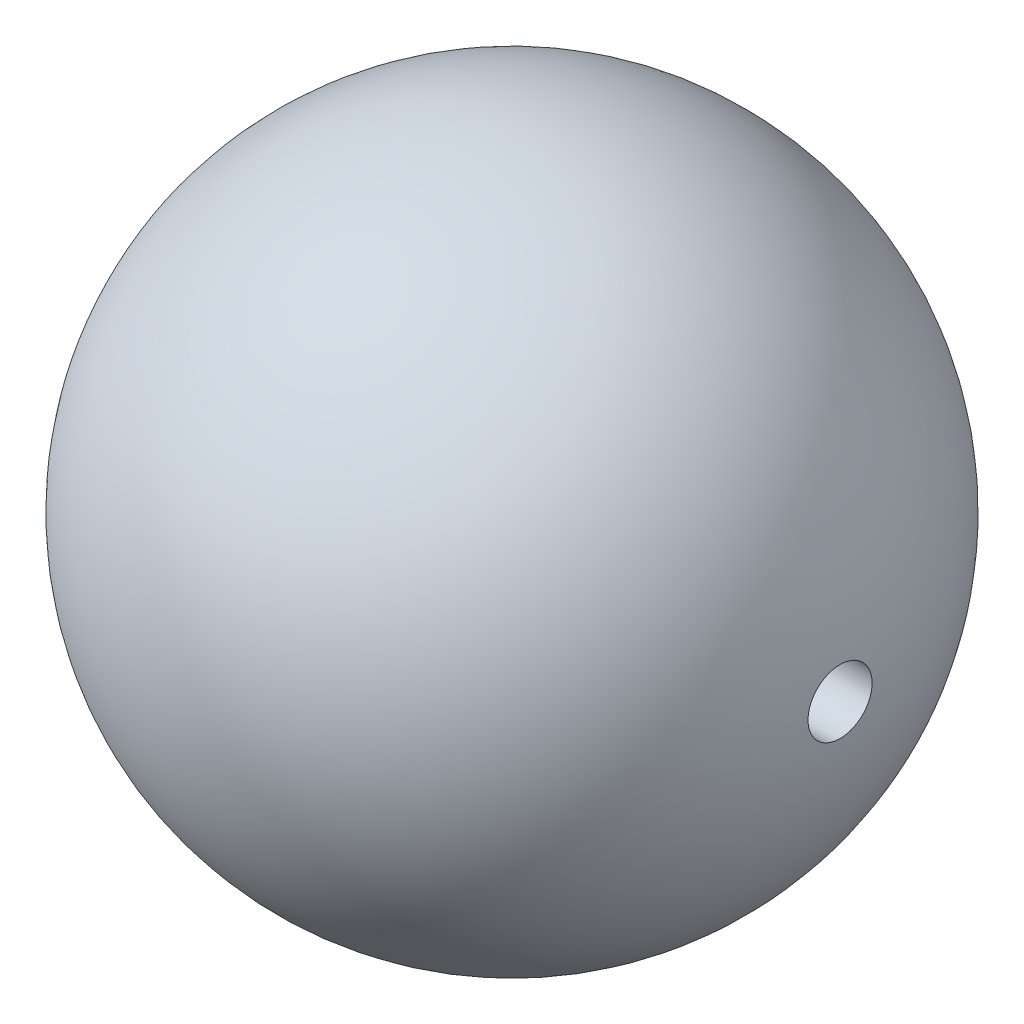
ISO-10303-21;
HEADER;
FILE_DESCRIPTION(('STEP AP214'),'2;1');
FILE_NAME('part.step','',(''),(''),'','','');
FILE_SCHEMA(('AUTOMOTIVE_DESIGN { 1 0 10303 214 1 1 1 1 }'));
ENDSEC;
DATA;
#1=APPLICATION_CONTEXT('core data for automotive mechanical design processes');
#2=APPLICATION_PROTOCOL_DEFINITION('international standard','automotive_design',2000,#1);
#3=PRODUCT_CONTEXT('',#1,'mechanical');
#4=PRODUCT('Part','Part','',(#3));
#5=PRODUCT_RELATED_PRODUCT_CATEGORY('part','',(#4));
#6=PRODUCT_DEFINITION_FORMATION('','',#4);
#7=PRODUCT_DEFINITION_CONTEXT('part definition',#1,'design');
#8=PRODUCT_DEFINITION('design','',#6,#7);
#9=PRODUCT_DEFINITION_SHAPE('','',#8);
#10=(LENGTH_UNIT() NAMED_UNIT(*) SI_UNIT(.MILLI.,.METRE.));
#11=(NAMED_UNIT(*) PLANE_ANGLE_UNIT() SI_UNIT($,.RADIAN.));
#12=(NAMED_UNIT(*) SI_UNIT($,.STERADIAN.) SOLID_ANGLE_UNIT());
#13=UNCERTAINTY_MEASURE_WITH_UNIT(LENGTH_MEASURE(1.E-05),#10,'distance_accuracy_value','');
#14=(GEOMETRIC_REPRESENTATION_CONTEXT(3) GLOBAL_UNCERTAINTY_ASSIGNED_CONTEXT((#13)) GLOBAL_UNIT_ASSIGNED_CONTEXT((#10,
#11,#12)) REPRESENTATION_CONTEXT('',''));
#15=CARTESIAN_POINT('',(0.,0.,0.));
#16=DIRECTION('',(0.,0.,1.));
#17=DIRECTION('',(1.,0.,0.));
#18=AXIS2_PLACEMENT_3D('',#15,#16,#17);
#19=CARTESIAN_POINT('',(0.,0.,0.));
#20=DIRECTION('',(1.,0.,0.));
#21=DIRECTION('',(0.,0.,-1.));
#22=AXIS2_PLACEMENT_3D('',#19,#20,#21);
#23=SPHERICAL_SURFACE('',#22,18.);
#24=CARTESIAN_POINT('',(17.9147285773466,0.,0.));
#25=DIRECTION('',(1.,0.,0.));
#26=DIRECTION('',(0.,0.,-1.));
#27=AXIS2_PLACEMENT_3D('',#24,#25,#26);
#28=CIRCLE('',#27,1.75);
#29=CARTESIAN_POINT('',(17.9147285773466,0.,-1.75));
#30=VERTEX_POINT('',#29);
#31=EDGE_CURVE('E37',#30,#30,#28,.T.);
#32=ORIENTED_EDGE('',*,*,#31,.F.);
#33=EDGE_LOOP('',(#32));
#34=FACE_BOUND('',#33,.T.);
#35=ADVANCED_FACE('F31',(#34),#23,.T.);
#36=CARTESIAN_POINT('',(-6.78992811988743,0.,0.));
#37=DIRECTION('',(1.,0.,0.));
#38=DIRECTION('',(0.,0.,-1.));
#39=AXIS2_PLACEMENT_3D('',#36,#37,#38);
#40=PLANE('',#39);
#41=CARTESIAN_POINT('',(-6.78992811988743,0.,0.));
#42=DIRECTION('',(1.,0.,0.));
#43=DIRECTION('',(0.,0.,-1.));
#44=AXIS2_PLACEMENT_3D('',#41,#42,#43);
#45=CIRCLE('',#44,1.75);
#46=CARTESIAN_POINT('',(-6.78992811988743,0.,-1.75));
#47=VERTEX_POINT('',#46);
#48=EDGE_CURVE('E10',#47,#47,#45,.T.);
#49=ORIENTED_EDGE('',*,*,#48,.T.);
#50=EDGE_LOOP('',(#49));
#51=FACE_BOUND('',#50,.T.);
#52=ADVANCED_FACE('F47',(#51),#40,.T.);
#53=CARTESIAN_POINT('',(-6.78992811988743,0.,0.));
#54=DIRECTION('',(1.,0.,0.));
#55=DIRECTION('',(0.,0.,-1.));
#56=AXIS2_PLACEMENT_3D('',#53,#54,#55);
#57=CYLINDRICAL_SURFACE('',#56,1.75);
#58=ORIENTED_EDGE('',*,*,#31,.T.);
#59=EDGE_LOOP('',(#58));
#60=FACE_BOUND('',#59,.T.);
#61=ORIENTED_EDGE('',*,*,#48,.F.);
#62=EDGE_LOOP('',(#61));
#63=FACE_BOUND('',#62,.T.);
#64=ADVANCED_FACE('F43',(#60,#63),#57,.F.);
#65=CLOSED_SHELL('',(#35,#52,#64));
#66=MANIFOLD_SOLID_BREP('B2',#65);
#67=ADVANCED_BREP_SHAPE_REPRESENTATION('',(#18,#66),#14);
#68=SHAPE_DEFINITION_REPRESENTATION(#9,#67);
ENDSEC;
END-ISO-10303-21;
